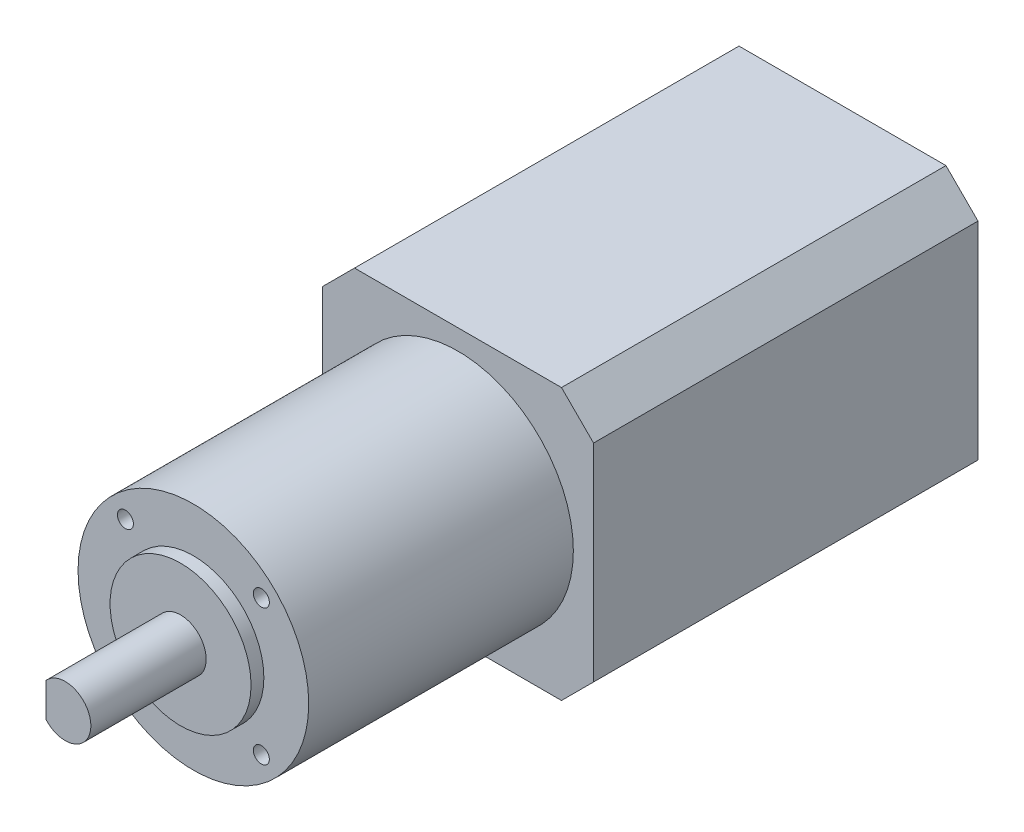
ISO-10303-21;
HEADER;
FILE_DESCRIPTION(('STEP AP214'),'2;1');
FILE_NAME('part.step','',(''),(''),'','','');
FILE_SCHEMA(('AUTOMOTIVE_DESIGN { 1 0 10303 214 1 1 1 1 }'));
ENDSEC;
DATA;
#1=APPLICATION_CONTEXT('core data for automotive mechanical design processes');
#2=APPLICATION_PROTOCOL_DEFINITION('international standard','automotive_design',2000,#1);
#3=PRODUCT_CONTEXT('',#1,'mechanical');
#4=PRODUCT('Part','Part','',(#3));
#5=PRODUCT_RELATED_PRODUCT_CATEGORY('part','',(#4));
#6=PRODUCT_DEFINITION_FORMATION('','',#4);
#7=PRODUCT_DEFINITION_CONTEXT('part definition',#1,'design');
#8=PRODUCT_DEFINITION('design','',#6,#7);
#9=PRODUCT_DEFINITION_SHAPE('','',#8);
#10=(LENGTH_UNIT() NAMED_UNIT(*) SI_UNIT(.MILLI.,.METRE.));
#11=(NAMED_UNIT(*) PLANE_ANGLE_UNIT() SI_UNIT($,.RADIAN.));
#12=(NAMED_UNIT(*) SI_UNIT($,.STERADIAN.) SOLID_ANGLE_UNIT());
#13=UNCERTAINTY_MEASURE_WITH_UNIT(LENGTH_MEASURE(1.E-05),#10,'distance_accuracy_value','');
#14=(GEOMETRIC_REPRESENTATION_CONTEXT(3) GLOBAL_UNCERTAINTY_ASSIGNED_CONTEXT((#13)) GLOBAL_UNIT_ASSIGNED_CONTEXT((#10,
#11,#12)) REPRESENTATION_CONTEXT('',''));
#15=CARTESIAN_POINT('',(0.,0.,0.));
#16=DIRECTION('',(0.,0.,1.));
#17=DIRECTION('',(1.,0.,0.));
#18=AXIS2_PLACEMENT_3D('',#15,#16,#17);
#19=CARTESIAN_POINT('',(-21.15,-16.15,60.));
#20=DIRECTION('',(1.,0.,0.));
#21=DIRECTION('',(0.,0.,-1.));
#22=AXIS2_PLACEMENT_3D('',#19,#20,#21);
#23=PLANE('',#22);
#24=DIRECTION('',(0.,-1.,0.));
#25=VECTOR('',#24,1.);
#26=CARTESIAN_POINT('',(-21.15,-16.15,0.));
#27=LINE('',#26,#25);
#28=CARTESIAN_POINT('',(-21.15,16.15,0.));
#29=VERTEX_POINT('',#28);
#30=CARTESIAN_POINT('',(-21.15,-16.15,0.));
#31=VERTEX_POINT('',#30);
#32=EDGE_CURVE('E154',#29,#31,#27,.T.);
#33=ORIENTED_EDGE('',*,*,#32,.T.);
#34=DIRECTION('',(0.,0.,-1.));
#35=VECTOR('',#34,1.);
#36=CARTESIAN_POINT('',(-21.15,-16.15,60.));
#37=LINE('',#36,#35);
#38=CARTESIAN_POINT('',(-21.15,-16.15,60.));
#39=VERTEX_POINT('',#38);
#40=EDGE_CURVE('E192',#39,#31,#37,.T.);
#41=ORIENTED_EDGE('',*,*,#40,.F.);
#42=DIRECTION('',(0.,-1.,0.));
#43=VECTOR('',#42,1.);
#44=CARTESIAN_POINT('',(-21.15,-16.15,60.));
#45=LINE('',#44,#43);
#46=CARTESIAN_POINT('',(-21.15,16.15,60.));
#47=VERTEX_POINT('',#46);
#48=EDGE_CURVE('E174',#47,#39,#45,.T.);
#49=ORIENTED_EDGE('',*,*,#48,.F.);
#50=DIRECTION('',(0.,0.,-1.));
#51=VECTOR('',#50,1.);
#52=CARTESIAN_POINT('',(-21.15,16.15,60.));
#53=LINE('',#52,#51);
#54=EDGE_CURVE('E150',#47,#29,#53,.T.);
#55=ORIENTED_EDGE('',*,*,#54,.T.);
#56=EDGE_LOOP('',(#33,#41,#49,#55));
#57=FACE_BOUND('',#56,.T.);
#58=ADVANCED_FACE('F40',(#57),#23,.F.);
#59=CARTESIAN_POINT('',(-21.15,-16.15,60.));
#60=DIRECTION('',(0.707106781186547,0.707106781186547,0.));
#61=DIRECTION('',(-0.707106781186548,0.707106781186548,0.));
#62=AXIS2_PLACEMENT_3D('',#59,#60,#61);
#63=PLANE('',#62);
#64=DIRECTION('',(0.707106781186548,-0.707106781186548,0.));
#65=VECTOR('',#64,1.);
#66=CARTESIAN_POINT('',(-21.15,-16.15,0.));
#67=LINE('',#66,#65);
#68=CARTESIAN_POINT('',(-16.15,-21.15,0.));
#69=VERTEX_POINT('',#68);
#70=EDGE_CURVE('E158',#31,#69,#67,.T.);
#71=ORIENTED_EDGE('',*,*,#70,.T.);
#72=DIRECTION('',(0.,0.,-1.));
#73=VECTOR('',#72,1.);
#74=CARTESIAN_POINT('',(-16.15,-21.15,60.));
#75=LINE('',#74,#73);
#76=CARTESIAN_POINT('',(-16.15,-21.15,60.));
#77=VERTEX_POINT('',#76);
#78=EDGE_CURVE('E188',#77,#69,#75,.T.);
#79=ORIENTED_EDGE('',*,*,#78,.F.);
#80=DIRECTION('',(0.707106781186548,-0.707106781186548,0.));
#81=VECTOR('',#80,1.);
#82=CARTESIAN_POINT('',(-21.15,-16.15,60.));
#83=LINE('',#82,#81);
#84=EDGE_CURVE('E106',#39,#77,#83,.T.);
#85=ORIENTED_EDGE('',*,*,#84,.F.);
#86=ORIENTED_EDGE('',*,*,#40,.T.);
#87=EDGE_LOOP('',(#71,#79,#85,#86));
#88=FACE_BOUND('',#87,.T.);
#89=ADVANCED_FACE('F267',(#88),#63,.F.);
#90=CARTESIAN_POINT('',(-16.15,-21.15,60.));
#91=DIRECTION('',(0.,1.,0.));
#92=DIRECTION('',(0.,0.,1.));
#93=AXIS2_PLACEMENT_3D('',#90,#91,#92);
#94=PLANE('',#93);
#95=DIRECTION('',(1.,0.,0.));
#96=VECTOR('',#95,1.);
#97=CARTESIAN_POINT('',(-16.15,-21.15,0.));
#98=LINE('',#97,#96);
#99=CARTESIAN_POINT('',(16.15,-21.15,0.));
#100=VERTEX_POINT('',#99);
#101=EDGE_CURVE('E161',#69,#100,#98,.T.);
#102=ORIENTED_EDGE('',*,*,#101,.T.);
#103=DIRECTION('',(0.,0.,-1.));
#104=VECTOR('',#103,1.);
#105=CARTESIAN_POINT('',(16.15,-21.15,60.));
#106=LINE('',#105,#104);
#107=CARTESIAN_POINT('',(16.15,-21.15,60.));
#108=VERTEX_POINT('',#107);
#109=EDGE_CURVE('E184',#108,#100,#106,.T.);
#110=ORIENTED_EDGE('',*,*,#109,.F.);
#111=DIRECTION('',(1.,0.,0.));
#112=VECTOR('',#111,1.);
#113=CARTESIAN_POINT('',(-16.15,-21.15,60.));
#114=LINE('',#113,#112);
#115=EDGE_CURVE('E247',#77,#108,#114,.T.);
#116=ORIENTED_EDGE('',*,*,#115,.F.);
#117=ORIENTED_EDGE('',*,*,#78,.T.);
#118=EDGE_LOOP('',(#102,#110,#116,#117));
#119=FACE_BOUND('',#118,.T.);
#120=ADVANCED_FACE('F270',(#119),#94,.F.);
#121=CARTESIAN_POINT('',(16.15,-21.15,60.));
#122=DIRECTION('',(-0.707106781186547,0.707106781186547,0.));
#123=DIRECTION('',(-0.707106781186548,-0.707106781186548,0.));
#124=AXIS2_PLACEMENT_3D('',#121,#122,#123);
#125=PLANE('',#124);
#126=DIRECTION('',(0.707106781186548,0.707106781186548,0.));
#127=VECTOR('',#126,1.);
#128=CARTESIAN_POINT('',(16.15,-21.15,0.));
#129=LINE('',#128,#127);
#130=CARTESIAN_POINT('',(21.15,-16.15,0.));
#131=VERTEX_POINT('',#130);
#132=EDGE_CURVE('E164',#100,#131,#129,.T.);
#133=ORIENTED_EDGE('',*,*,#132,.T.);
#134=DIRECTION('',(0.,0.,-1.));
#135=VECTOR('',#134,1.);
#136=CARTESIAN_POINT('',(21.15,-16.15,60.));
#137=LINE('',#136,#135);
#138=CARTESIAN_POINT('',(21.15,-16.15,60.));
#139=VERTEX_POINT('',#138);
#140=EDGE_CURVE('E180',#139,#131,#137,.T.);
#141=ORIENTED_EDGE('',*,*,#140,.F.);
#142=DIRECTION('',(0.707106781186548,0.707106781186548,0.));
#143=VECTOR('',#142,1.);
#144=CARTESIAN_POINT('',(16.15,-21.15,60.));
#145=LINE('',#144,#143);
#146=EDGE_CURVE('E249',#108,#139,#145,.T.);
#147=ORIENTED_EDGE('',*,*,#146,.F.);
#148=ORIENTED_EDGE('',*,*,#109,.T.);
#149=EDGE_LOOP('',(#133,#141,#147,#148));
#150=FACE_BOUND('',#149,.T.);
#151=ADVANCED_FACE('F255',(#150),#125,.F.);
#152=CARTESIAN_POINT('',(21.15,-16.15,60.));
#153=DIRECTION('',(-1.,0.,0.));
#154=DIRECTION('',(0.,0.,1.));
#155=AXIS2_PLACEMENT_3D('',#152,#153,#154);
#156=PLANE('',#155);
#157=DIRECTION('',(0.,1.,0.));
#158=VECTOR('',#157,1.);
#159=CARTESIAN_POINT('',(21.15,-16.15,0.));
#160=LINE('',#159,#158);
#161=CARTESIAN_POINT('',(21.15,16.15,0.));
#162=VERTEX_POINT('',#161);
#163=EDGE_CURVE('E166',#131,#162,#160,.T.);
#164=ORIENTED_EDGE('',*,*,#163,.T.);
#165=DIRECTION('',(0.,0.,-1.));
#166=VECTOR('',#165,1.);
#167=CARTESIAN_POINT('',(21.15,16.15,60.));
#168=LINE('',#167,#166);
#169=CARTESIAN_POINT('',(21.15,16.15,60.));
#170=VERTEX_POINT('',#169);
#171=EDGE_CURVE('E141',#170,#162,#168,.T.);
#172=ORIENTED_EDGE('',*,*,#171,.F.);
#173=DIRECTION('',(0.,1.,0.));
#174=VECTOR('',#173,1.);
#175=CARTESIAN_POINT('',(21.15,-16.15,60.));
#176=LINE('',#175,#174);
#177=EDGE_CURVE('E128',#139,#170,#176,.T.);
#178=ORIENTED_EDGE('',*,*,#177,.F.);
#179=ORIENTED_EDGE('',*,*,#140,.T.);
#180=EDGE_LOOP('',(#164,#172,#178,#179));
#181=FACE_BOUND('',#180,.T.);
#182=ADVANCED_FACE('F259',(#181),#156,.F.);
#183=CARTESIAN_POINT('',(16.15,21.15,60.));
#184=DIRECTION('',(-0.707106781186547,-0.707106781186547,0.));
#185=DIRECTION('',(0.707106781186548,-0.707106781186548,0.));
#186=AXIS2_PLACEMENT_3D('',#183,#184,#185);
#187=PLANE('',#186);
#188=DIRECTION('',(-0.707106781186548,0.707106781186548,0.));
#189=VECTOR('',#188,1.);
#190=CARTESIAN_POINT('',(16.15,21.15,0.));
#191=LINE('',#190,#189);
#192=CARTESIAN_POINT('',(16.15,21.15,0.));
#193=VERTEX_POINT('',#192);
#194=EDGE_CURVE('E138',#162,#193,#191,.T.);
#195=ORIENTED_EDGE('',*,*,#194,.T.);
#196=DIRECTION('',(0.,0.,-1.));
#197=VECTOR('',#196,1.);
#198=CARTESIAN_POINT('',(16.15,21.15,60.));
#199=LINE('',#198,#197);
#200=CARTESIAN_POINT('',(16.15,21.15,60.));
#201=VERTEX_POINT('',#200);
#202=EDGE_CURVE('E135',#201,#193,#199,.T.);
#203=ORIENTED_EDGE('',*,*,#202,.F.);
#204=DIRECTION('',(-0.707106781186548,0.707106781186548,0.));
#205=VECTOR('',#204,1.);
#206=CARTESIAN_POINT('',(16.15,21.15,60.));
#207=LINE('',#206,#205);
#208=EDGE_CURVE('E121',#170,#201,#207,.T.);
#209=ORIENTED_EDGE('',*,*,#208,.F.);
#210=ORIENTED_EDGE('',*,*,#171,.T.);
#211=EDGE_LOOP('',(#195,#203,#209,#210));
#212=FACE_BOUND('',#211,.T.);
#213=ADVANCED_FACE('F136',(#212),#187,.F.);
#214=CARTESIAN_POINT('',(-16.15,21.15,60.));
#215=DIRECTION('',(0.,-1.,0.));
#216=DIRECTION('',(0.,0.,-1.));
#217=AXIS2_PLACEMENT_3D('',#214,#215,#216);
#218=PLANE('',#217);
#219=DIRECTION('',(-1.,0.,0.));
#220=VECTOR('',#219,1.);
#221=CARTESIAN_POINT('',(-16.15,21.15,0.));
#222=LINE('',#221,#220);
#223=CARTESIAN_POINT('',(-16.15,21.15,0.));
#224=VERTEX_POINT('',#223);
#225=EDGE_CURVE('E170',#193,#224,#222,.T.);
#226=ORIENTED_EDGE('',*,*,#225,.T.);
#227=DIRECTION('',(0.,0.,-1.));
#228=VECTOR('',#227,1.);
#229=CARTESIAN_POINT('',(-16.15,21.15,60.));
#230=LINE('',#229,#228);
#231=CARTESIAN_POINT('',(-16.15,21.15,60.));
#232=VERTEX_POINT('',#231);
#233=EDGE_CURVE('E142',#232,#224,#230,.T.);
#234=ORIENTED_EDGE('',*,*,#233,.F.);
#235=DIRECTION('',(-1.,0.,0.));
#236=VECTOR('',#235,1.);
#237=CARTESIAN_POINT('',(-16.15,21.15,60.));
#238=LINE('',#237,#236);
#239=EDGE_CURVE('E125',#201,#232,#238,.T.);
#240=ORIENTED_EDGE('',*,*,#239,.F.);
#241=ORIENTED_EDGE('',*,*,#202,.T.);
#242=EDGE_LOOP('',(#226,#234,#240,#241));
#243=FACE_BOUND('',#242,.T.);
#244=ADVANCED_FACE('F144',(#243),#218,.F.);
#245=CARTESIAN_POINT('',(-21.15,16.15,60.));
#246=DIRECTION('',(0.707106781186547,-0.707106781186547,0.));
#247=DIRECTION('',(0.707106781186548,0.707106781186548,0.));
#248=AXIS2_PLACEMENT_3D('',#245,#246,#247);
#249=PLANE('',#248);
#250=DIRECTION('',(-0.707106781186548,-0.707106781186548,0.));
#251=VECTOR('',#250,1.);
#252=CARTESIAN_POINT('',(-21.15,16.15,0.));
#253=LINE('',#252,#251);
#254=EDGE_CURVE('E97',#224,#29,#253,.T.);
#255=ORIENTED_EDGE('',*,*,#254,.T.);
#256=ORIENTED_EDGE('',*,*,#54,.F.);
#257=DIRECTION('',(-0.707106781186548,-0.707106781186548,0.));
#258=VECTOR('',#257,1.);
#259=CARTESIAN_POINT('',(-21.15,16.15,60.));
#260=LINE('',#259,#258);
#261=EDGE_CURVE('E64',#232,#47,#260,.T.);
#262=ORIENTED_EDGE('',*,*,#261,.F.);
#263=ORIENTED_EDGE('',*,*,#233,.T.);
#264=EDGE_LOOP('',(#255,#256,#262,#263));
#265=FACE_BOUND('',#264,.T.);
#266=ADVANCED_FACE('F263',(#265),#249,.F.);
#267=CARTESIAN_POINT('',(0.,0.,60.));
#268=DIRECTION('',(0.,0.,-1.));
#269=DIRECTION('',(-1.,0.,0.));
#270=AXIS2_PLACEMENT_3D('',#267,#268,#269);
#271=PLANE('',#270);
#272=CARTESIAN_POINT('',(0.,0.,60.));
#273=DIRECTION('',(0.,0.,-1.));
#274=DIRECTION('',(-1.,0.,0.));
#275=AXIS2_PLACEMENT_3D('',#272,#273,#274);
#276=CIRCLE('',#275,18.);
#277=CARTESIAN_POINT('',(-18.,0.,60.));
#278=VERTEX_POINT('',#277);
#279=EDGE_CURVE('E195',#278,#278,#276,.F.);
#280=ORIENTED_EDGE('',*,*,#279,.F.);
#281=EDGE_LOOP('',(#280));
#282=FACE_BOUND('',#281,.T.);
#283=ORIENTED_EDGE('',*,*,#48,.T.);
#284=ORIENTED_EDGE('',*,*,#84,.T.);
#285=ORIENTED_EDGE('',*,*,#115,.T.);
#286=ORIENTED_EDGE('',*,*,#146,.T.);
#287=ORIENTED_EDGE('',*,*,#177,.T.);
#288=ORIENTED_EDGE('',*,*,#208,.T.);
#289=ORIENTED_EDGE('',*,*,#239,.T.);
#290=ORIENTED_EDGE('',*,*,#261,.T.);
#291=EDGE_LOOP('',(#283,#284,#285,#286,#287,#288,#289,#290));
#292=FACE_BOUND('',#291,.T.);
#293=ADVANCED_FACE('F123',(#282,#292),#271,.F.);
#294=CARTESIAN_POINT('',(0.,0.,0.));
#295=DIRECTION('',(0.,0.,-1.));
#296=DIRECTION('',(-1.,0.,0.));
#297=AXIS2_PLACEMENT_3D('',#294,#295,#296);
#298=PLANE('',#297);
#299=ORIENTED_EDGE('',*,*,#32,.F.);
#300=ORIENTED_EDGE('',*,*,#254,.F.);
#301=ORIENTED_EDGE('',*,*,#225,.F.);
#302=ORIENTED_EDGE('',*,*,#194,.F.);
#303=ORIENTED_EDGE('',*,*,#163,.F.);
#304=ORIENTED_EDGE('',*,*,#132,.F.);
#305=ORIENTED_EDGE('',*,*,#101,.F.);
#306=ORIENTED_EDGE('',*,*,#70,.F.);
#307=EDGE_LOOP('',(#299,#300,#301,#302,#303,#304,#305,#306));
#308=FACE_BOUND('',#307,.T.);
#309=ADVANCED_FACE('F262',(#308),#298,.T.);
#310=CARTESIAN_POINT('',(0.,0.,101.3));
#311=DIRECTION('',(0.,0.,-1.));
#312=DIRECTION('',(-1.,0.,0.));
#313=AXIS2_PLACEMENT_3D('',#310,#311,#312);
#314=CYLINDRICAL_SURFACE('',#313,18.);
#315=CARTESIAN_POINT('',(0.,0.,101.3));
#316=DIRECTION('',(0.,0.,1.));
#317=DIRECTION('',(1.,0.,0.));
#318=AXIS2_PLACEMENT_3D('',#315,#316,#317);
#319=CIRCLE('',#318,18.);
#320=CARTESIAN_POINT('',(18.,0.,101.3));
#321=VERTEX_POINT('',#320);
#322=EDGE_CURVE('E159',#321,#321,#319,.T.);
#323=ORIENTED_EDGE('',*,*,#322,.F.);
#324=EDGE_LOOP('',(#323));
#325=FACE_BOUND('',#324,.T.);
#326=ORIENTED_EDGE('',*,*,#279,.T.);
#327=EDGE_LOOP('',(#326));
#328=FACE_BOUND('',#327,.T.);
#329=ADVANCED_FACE('F348',(#325,#328),#314,.T.);
#330=CARTESIAN_POINT('',(0.,0.,101.3));
#331=DIRECTION('',(0.,0.,1.));
#332=DIRECTION('',(1.,0.,0.));
#333=AXIS2_PLACEMENT_3D('',#330,#331,#332);
#334=PLANE('',#333);
#335=CARTESIAN_POINT('',(-10.6066017177982,10.6066017177982,101.3));
#336=DIRECTION('',(0.,0.,1.));
#337=DIRECTION('',(1.,0.,0.));
#338=AXIS2_PLACEMENT_3D('',#335,#336,#337);
#339=CIRCLE('',#338,1.25);
#340=CARTESIAN_POINT('',(-9.35660171779822,10.6066017177982,101.3));
#341=VERTEX_POINT('',#340);
#342=EDGE_CURVE('E547',#341,#341,#339,.T.);
#343=ORIENTED_EDGE('',*,*,#342,.F.);
#344=EDGE_LOOP('',(#343));
#345=FACE_BOUND('',#344,.T.);
#346=CARTESIAN_POINT('',(10.6066017177982,10.6066017177982,101.3));
#347=DIRECTION('',(0.,0.,1.));
#348=DIRECTION('',(1.,0.,0.));
#349=AXIS2_PLACEMENT_3D('',#346,#347,#348);
#350=CIRCLE('',#349,1.25);
#351=CARTESIAN_POINT('',(11.8566017177982,10.6066017177982,101.3));
#352=VERTEX_POINT('',#351);
#353=EDGE_CURVE('E549',#352,#352,#350,.T.);
#354=ORIENTED_EDGE('',*,*,#353,.F.);
#355=EDGE_LOOP('',(#354));
#356=FACE_BOUND('',#355,.T.);
#357=CARTESIAN_POINT('',(-10.6066017177982,-10.6066017177982,101.3));
#358=DIRECTION('',(0.,0.,1.));
#359=DIRECTION('',(1.,0.,0.));
#360=AXIS2_PLACEMENT_3D('',#357,#358,#359);
#361=CIRCLE('',#360,1.25);
#362=CARTESIAN_POINT('',(-9.35660171779822,-10.6066017177982,101.3));
#363=VERTEX_POINT('',#362);
#364=EDGE_CURVE('E557',#363,#363,#361,.T.);
#365=ORIENTED_EDGE('',*,*,#364,.F.);
#366=EDGE_LOOP('',(#365));
#367=FACE_BOUND('',#366,.T.);
#368=CARTESIAN_POINT('',(10.6066017177982,-10.6066017177982,101.3));
#369=DIRECTION('',(0.,0.,1.));
#370=DIRECTION('',(1.,0.,0.));
#371=AXIS2_PLACEMENT_3D('',#368,#369,#370);
#372=CIRCLE('',#371,1.25);
#373=CARTESIAN_POINT('',(11.8566017177982,-10.6066017177982,101.3));
#374=VERTEX_POINT('',#373);
#375=EDGE_CURVE('E563',#374,#374,#372,.T.);
#376=ORIENTED_EDGE('',*,*,#375,.F.);
#377=EDGE_LOOP('',(#376));
#378=FACE_BOUND('',#377,.T.);
#379=CARTESIAN_POINT('',(0.,0.,101.3));
#380=DIRECTION('',(0.,0.,1.));
#381=DIRECTION('',(1.,0.,0.));
#382=AXIS2_PLACEMENT_3D('',#379,#380,#381);
#383=CIRCLE('',#382,11.);
#384=CARTESIAN_POINT('',(11.,0.,101.3));
#385=VERTEX_POINT('',#384);
#386=EDGE_CURVE('E223',#385,#385,#383,.T.);
#387=ORIENTED_EDGE('',*,*,#386,.F.);
#388=EDGE_LOOP('',(#387));
#389=FACE_BOUND('',#388,.T.);
#390=ORIENTED_EDGE('',*,*,#322,.T.);
#391=EDGE_LOOP('',(#390));
#392=FACE_BOUND('',#391,.T.);
#393=ADVANCED_FACE('F366',(#345,#356,#367,#378,#389,#392),#334,.T.);
#394=CARTESIAN_POINT('',(0.,0.,103.3));
#395=DIRECTION('',(0.,0.,-1.));
#396=DIRECTION('',(-1.,0.,0.));
#397=AXIS2_PLACEMENT_3D('',#394,#395,#396);
#398=CYLINDRICAL_SURFACE('',#397,11.);
#399=CARTESIAN_POINT('',(0.,0.,103.3));
#400=DIRECTION('',(0.,0.,1.));
#401=DIRECTION('',(1.,0.,0.));
#402=AXIS2_PLACEMENT_3D('',#399,#400,#401);
#403=CIRCLE('',#402,11.);
#404=CARTESIAN_POINT('',(11.,0.,103.3));
#405=VERTEX_POINT('',#404);
#406=EDGE_CURVE('E230',#405,#405,#403,.T.);
#407=ORIENTED_EDGE('',*,*,#406,.F.);
#408=EDGE_LOOP('',(#407));
#409=FACE_BOUND('',#408,.T.);
#410=ORIENTED_EDGE('',*,*,#386,.T.);
#411=EDGE_LOOP('',(#410));
#412=FACE_BOUND('',#411,.T.);
#413=ADVANCED_FACE('F373',(#409,#412),#398,.T.);
#414=CARTESIAN_POINT('',(0.,0.,103.3));
#415=DIRECTION('',(0.,0.,1.));
#416=DIRECTION('',(1.,0.,0.));
#417=AXIS2_PLACEMENT_3D('',#414,#415,#416);
#418=PLANE('',#417);
#419=CARTESIAN_POINT('',(0.,0.,103.3));
#420=DIRECTION('',(0.,0.,1.));
#421=DIRECTION('',(1.,0.,0.));
#422=AXIS2_PLACEMENT_3D('',#419,#420,#421);
#423=CIRCLE('',#422,4.);
#424=CARTESIAN_POINT('',(4.,0.,103.3));
#425=VERTEX_POINT('',#424);
#426=EDGE_CURVE('E224',#425,#425,#423,.T.);
#427=ORIENTED_EDGE('',*,*,#426,.F.);
#428=EDGE_LOOP('',(#427));
#429=FACE_BOUND('',#428,.T.);
#430=ORIENTED_EDGE('',*,*,#406,.T.);
#431=EDGE_LOOP('',(#430));
#432=FACE_BOUND('',#431,.T.);
#433=ADVANCED_FACE('F379',(#429,#432),#418,.T.);
#434=CARTESIAN_POINT('',(0.,0.,121.3));
#435=DIRECTION('',(0.,0.,-1.));
#436=DIRECTION('',(-1.,0.,0.));
#437=AXIS2_PLACEMENT_3D('',#434,#435,#436);
#438=CYLINDRICAL_SURFACE('',#437,4.);
#439=CARTESIAN_POINT('',(0.,0.,121.3));
#440=DIRECTION('',(0.,0.,1.));
#441=DIRECTION('',(1.,0.,0.));
#442=AXIS2_PLACEMENT_3D('',#439,#440,#441);
#443=CIRCLE('',#442,4.);
#444=CARTESIAN_POINT('',(-3.,-2.64575131106459,121.3));
#445=VERTEX_POINT('',#444);
#446=CARTESIAN_POINT('',(-3.,2.64575131106459,121.3));
#447=VERTEX_POINT('',#446);
#448=EDGE_CURVE('E216',#445,#447,#443,.T.);
#449=ORIENTED_EDGE('',*,*,#448,.F.);
#450=DIRECTION('',(0.,0.,-1.));
#451=VECTOR('',#450,1.);
#452=CARTESIAN_POINT('',(-3.,-2.64575131106459,121.3));
#453=LINE('',#452,#451);
#454=CARTESIAN_POINT('',(-3.,-2.64575131106459,106.3));
#455=VERTEX_POINT('',#454);
#456=EDGE_CURVE('E55',#445,#455,#453,.T.);
#457=ORIENTED_EDGE('',*,*,#456,.T.);
#458=CARTESIAN_POINT('',(0.,0.,106.3));
#459=DIRECTION('',(0.,0.,-1.));
#460=DIRECTION('',(-1.,0.,0.));
#461=AXIS2_PLACEMENT_3D('',#458,#459,#460);
#462=CIRCLE('',#461,4.);
#463=CARTESIAN_POINT('',(-3.,2.64575131106459,106.3));
#464=VERTEX_POINT('',#463);
#465=EDGE_CURVE('E11',#455,#464,#462,.T.);
#466=ORIENTED_EDGE('',*,*,#465,.T.);
#467=DIRECTION('',(0.,0.,-1.));
#468=VECTOR('',#467,1.);
#469=CARTESIAN_POINT('',(-3.,2.64575131106459,121.3));
#470=LINE('',#469,#468);
#471=EDGE_CURVE('E205',#464,#447,#470,.F.);
#472=ORIENTED_EDGE('',*,*,#471,.T.);
#473=EDGE_LOOP('',(#449,#457,#466,#472));
#474=FACE_BOUND('',#473,.T.);
#475=ORIENTED_EDGE('',*,*,#426,.T.);
#476=EDGE_LOOP('',(#475));
#477=FACE_BOUND('',#476,.T.);
#478=ADVANCED_FACE('F214',(#474,#477),#438,.T.);
#479=CARTESIAN_POINT('',(0.,0.,121.3));
#480=DIRECTION('',(0.,0.,1.));
#481=DIRECTION('',(1.,0.,0.));
#482=AXIS2_PLACEMENT_3D('',#479,#480,#481);
#483=PLANE('',#482);
#484=DIRECTION('',(0.,1.,0.));
#485=VECTOR('',#484,1.);
#486=CARTESIAN_POINT('',(-3.,0.,121.3));
#487=LINE('',#486,#485);
#488=EDGE_CURVE('E48',#445,#447,#487,.T.);
#489=ORIENTED_EDGE('',*,*,#488,.F.);
#490=ORIENTED_EDGE('',*,*,#448,.T.);
#491=EDGE_LOOP('',(#489,#490));
#492=FACE_BOUND('',#491,.T.);
#493=ADVANCED_FACE('F221',(#492),#483,.T.);
#494=CARTESIAN_POINT('',(0.,0.,106.3));
#495=DIRECTION('',(0.,0.,-1.));
#496=DIRECTION('',(-1.,0.,0.));
#497=AXIS2_PLACEMENT_3D('',#494,#495,#496);
#498=PLANE('',#497);
#499=DIRECTION('',(0.,1.,0.));
#500=VECTOR('',#499,1.);
#501=CARTESIAN_POINT('',(-3.,5.37794837193809,106.3));
#502=LINE('',#501,#500);
#503=EDGE_CURVE('E219',#455,#464,#502,.T.);
#504=ORIENTED_EDGE('',*,*,#503,.T.);
#505=ORIENTED_EDGE('',*,*,#465,.F.);
#506=EDGE_LOOP('',(#504,#505));
#507=FACE_BOUND('',#506,.T.);
#508=ADVANCED_FACE('F409',(#507),#498,.F.);
#509=CARTESIAN_POINT('',(-3.,5.37794837193809,106.3));
#510=DIRECTION('',(1.,0.,0.));
#511=DIRECTION('',(0.,1.,0.));
#512=AXIS2_PLACEMENT_3D('',#509,#510,#511);
#513=PLANE('',#512);
#514=ORIENTED_EDGE('',*,*,#488,.T.);
#515=ORIENTED_EDGE('',*,*,#471,.F.);
#516=ORIENTED_EDGE('',*,*,#503,.F.);
#517=ORIENTED_EDGE('',*,*,#456,.F.);
#518=EDGE_LOOP('',(#514,#515,#516,#517));
#519=FACE_BOUND('',#518,.T.);
#520=ADVANCED_FACE('F204',(#519),#513,.F.);
#521=CARTESIAN_POINT('',(10.6066017177982,-10.6066017177982,93.8));
#522=DIRECTION('',(0.,0.,1.));
#523=DIRECTION('',(1.,0.,0.));
#524=AXIS2_PLACEMENT_3D('',#521,#522,#523);
#525=CONICAL_SURFACE('',#524,1.25,1.02974425867666);
#526=CARTESIAN_POINT('',(10.6066017177982,-10.6066017177982,93.0489242262155));
#527=VERTEX_POINT('',#526);
#528=VERTEX_LOOP('',#527);
#529=FACE_BOUND('',#528,.T.);
#530=CARTESIAN_POINT('',(10.6066017177982,-10.6066017177982,93.8));
#531=DIRECTION('',(0.,0.,1.));
#532=DIRECTION('',(1.,0.,0.));
#533=AXIS2_PLACEMENT_3D('',#530,#531,#532);
#534=CIRCLE('',#533,1.25);
#535=CARTESIAN_POINT('',(11.8566017177982,-10.6066017177982,93.8));
#536=VERTEX_POINT('',#535);
#537=EDGE_CURVE('E566',#536,#536,#534,.T.);
#538=ORIENTED_EDGE('',*,*,#537,.T.);
#539=EDGE_LOOP('',(#538));
#540=FACE_BOUND('',#539,.T.);
#541=ADVANCED_FACE('F427',(#529,#540),#525,.F.);
#542=CARTESIAN_POINT('',(10.6066017177982,-10.6066017177982,101.3));
#543=DIRECTION('',(0.,0.,1.));
#544=DIRECTION('',(1.,0.,0.));
#545=AXIS2_PLACEMENT_3D('',#542,#543,#544);
#546=CYLINDRICAL_SURFACE('',#545,1.25);
#547=ORIENTED_EDGE('',*,*,#537,.F.);
#548=EDGE_LOOP('',(#547));
#549=FACE_BOUND('',#548,.T.);
#550=ORIENTED_EDGE('',*,*,#375,.T.);
#551=EDGE_LOOP('',(#550));
#552=FACE_BOUND('',#551,.T.);
#553=ADVANCED_FACE('F445',(#549,#552),#546,.F.);
#554=CARTESIAN_POINT('',(-10.6066017177982,-10.6066017177982,93.8));
#555=DIRECTION('',(0.,0.,1.));
#556=DIRECTION('',(1.,0.,0.));
#557=AXIS2_PLACEMENT_3D('',#554,#555,#556);
#558=CONICAL_SURFACE('',#557,1.25,1.02974425867666);
#559=CARTESIAN_POINT('',(-10.6066017177982,-10.6066017177982,93.0489242262155));
#560=VERTEX_POINT('',#559);
#561=VERTEX_LOOP('',#560);
#562=FACE_BOUND('',#561,.T.);
#563=CARTESIAN_POINT('',(-10.6066017177982,-10.6066017177982,93.8));
#564=DIRECTION('',(0.,0.,1.));
#565=DIRECTION('',(1.,0.,0.));
#566=AXIS2_PLACEMENT_3D('',#563,#564,#565);
#567=CIRCLE('',#566,1.25);
#568=CARTESIAN_POINT('',(-9.35660171779822,-10.6066017177982,93.8));
#569=VERTEX_POINT('',#568);
#570=EDGE_CURVE('E560',#569,#569,#567,.T.);
#571=ORIENTED_EDGE('',*,*,#570,.T.);
#572=EDGE_LOOP('',(#571));
#573=FACE_BOUND('',#572,.T.);
#574=ADVANCED_FACE('F456',(#562,#573),#558,.F.);
#575=CARTESIAN_POINT('',(-10.6066017177982,-10.6066017177982,101.3));
#576=DIRECTION('',(0.,0.,1.));
#577=DIRECTION('',(1.,0.,0.));
#578=AXIS2_PLACEMENT_3D('',#575,#576,#577);
#579=CYLINDRICAL_SURFACE('',#578,1.25);
#580=ORIENTED_EDGE('',*,*,#570,.F.);
#581=EDGE_LOOP('',(#580));
#582=FACE_BOUND('',#581,.T.);
#583=ORIENTED_EDGE('',*,*,#364,.T.);
#584=EDGE_LOOP('',(#583));
#585=FACE_BOUND('',#584,.T.);
#586=ADVANCED_FACE('F468',(#582,#585),#579,.F.);
#587=CARTESIAN_POINT('',(10.6066017177982,10.6066017177982,93.8));
#588=DIRECTION('',(0.,0.,1.));
#589=DIRECTION('',(1.,0.,0.));
#590=AXIS2_PLACEMENT_3D('',#587,#588,#589);
#591=CONICAL_SURFACE('',#590,1.25,1.02974425867666);
#592=CARTESIAN_POINT('',(10.6066017177982,10.6066017177982,93.0489242262155));
#593=VERTEX_POINT('',#592);
#594=VERTEX_LOOP('',#593);
#595=FACE_BOUND('',#594,.T.);
#596=CARTESIAN_POINT('',(10.6066017177982,10.6066017177982,93.8));
#597=DIRECTION('',(0.,0.,1.));
#598=DIRECTION('',(1.,0.,0.));
#599=AXIS2_PLACEMENT_3D('',#596,#597,#598);
#600=CIRCLE('',#599,1.25);
#601=CARTESIAN_POINT('',(11.8566017177982,10.6066017177982,93.8));
#602=VERTEX_POINT('',#601);
#603=EDGE_CURVE('E554',#602,#602,#600,.T.);
#604=ORIENTED_EDGE('',*,*,#603,.T.);
#605=EDGE_LOOP('',(#604));
#606=FACE_BOUND('',#605,.T.);
#607=ADVANCED_FACE('F478',(#595,#606),#591,.F.);
#608=CARTESIAN_POINT('',(10.6066017177982,10.6066017177982,101.3));
#609=DIRECTION('',(0.,0.,1.));
#610=DIRECTION('',(1.,0.,0.));
#611=AXIS2_PLACEMENT_3D('',#608,#609,#610);
#612=CYLINDRICAL_SURFACE('',#611,1.25);
#613=ORIENTED_EDGE('',*,*,#603,.F.);
#614=EDGE_LOOP('',(#613));
#615=FACE_BOUND('',#614,.T.);
#616=ORIENTED_EDGE('',*,*,#353,.T.);
#617=EDGE_LOOP('',(#616));
#618=FACE_BOUND('',#617,.T.);
#619=ADVANCED_FACE('F489',(#615,#618),#612,.F.);
#620=CARTESIAN_POINT('',(-10.6066017177982,10.6066017177982,93.8));
#621=DIRECTION('',(0.,0.,1.));
#622=DIRECTION('',(1.,0.,0.));
#623=AXIS2_PLACEMENT_3D('',#620,#621,#622);
#624=CONICAL_SURFACE('',#623,1.25,1.02974425867666);
#625=CARTESIAN_POINT('',(-10.6066017177982,10.6066017177982,93.0489242262155));
#626=VERTEX_POINT('',#625);
#627=VERTEX_LOOP('',#626);
#628=FACE_BOUND('',#627,.T.);
#629=CARTESIAN_POINT('',(-10.6066017177982,10.6066017177982,93.8));
#630=DIRECTION('',(0.,0.,1.));
#631=DIRECTION('',(1.,0.,0.));
#632=AXIS2_PLACEMENT_3D('',#629,#630,#631);
#633=CIRCLE('',#632,1.25);
#634=CARTESIAN_POINT('',(-9.35660171779822,10.6066017177982,93.8));
#635=VERTEX_POINT('',#634);
#636=EDGE_CURVE('E544',#635,#635,#633,.T.);
#637=ORIENTED_EDGE('',*,*,#636,.T.);
#638=EDGE_LOOP('',(#637));
#639=FACE_BOUND('',#638,.T.);
#640=ADVANCED_FACE('F499',(#628,#639),#624,.F.);
#641=CARTESIAN_POINT('',(-10.6066017177982,10.6066017177982,101.3));
#642=DIRECTION('',(0.,0.,1.));
#643=DIRECTION('',(1.,0.,0.));
#644=AXIS2_PLACEMENT_3D('',#641,#642,#643);
#645=CYLINDRICAL_SURFACE('',#644,1.25);
#646=ORIENTED_EDGE('',*,*,#636,.F.);
#647=EDGE_LOOP('',(#646));
#648=FACE_BOUND('',#647,.T.);
#649=ORIENTED_EDGE('',*,*,#342,.T.);
#650=EDGE_LOOP('',(#649));
#651=FACE_BOUND('',#650,.T.);
#652=ADVANCED_FACE('F511',(#648,#651),#645,.F.);
#653=CLOSED_SHELL('',(#58,#89,#120,#151,#182,#213,#244,#266,#293,#309,#329,#393,#413,#433,#478,
#493,#508,#520,#541,#553,#574,#586,#607,#619,#640,#652));
#654=MANIFOLD_SOLID_BREP('B2',#653);
#655=ADVANCED_BREP_SHAPE_REPRESENTATION('',(#18,#654),#14);
#656=SHAPE_DEFINITION_REPRESENTATION(#9,#655);
ENDSEC;
END-ISO-10303-21;
